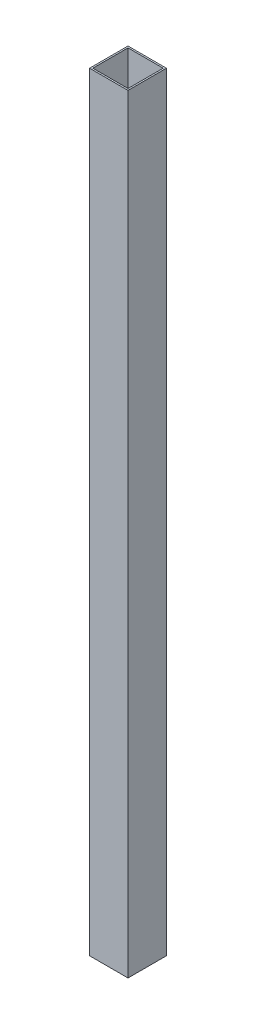
ISO-10303-21;
HEADER;
FILE_DESCRIPTION(('STEP AP214'),'2;1');
FILE_NAME('part.step','',(''),(''),'','','');
FILE_SCHEMA(('AUTOMOTIVE_DESIGN { 1 0 10303 214 1 1 1 1 }'));
ENDSEC;
DATA;
#1=APPLICATION_CONTEXT('core data for automotive mechanical design processes');
#2=APPLICATION_PROTOCOL_DEFINITION('international standard','automotive_design',2000,#1);
#3=PRODUCT_CONTEXT('',#1,'mechanical');
#4=PRODUCT('Part','Part','',(#3));
#5=PRODUCT_RELATED_PRODUCT_CATEGORY('part','',(#4));
#6=PRODUCT_DEFINITION_FORMATION('','',#4);
#7=PRODUCT_DEFINITION_CONTEXT('part definition',#1,'design');
#8=PRODUCT_DEFINITION('design','',#6,#7);
#9=PRODUCT_DEFINITION_SHAPE('','',#8);
#10=(LENGTH_UNIT() NAMED_UNIT(*) SI_UNIT(.MILLI.,.METRE.));
#11=(NAMED_UNIT(*) PLANE_ANGLE_UNIT() SI_UNIT($,.RADIAN.));
#12=(NAMED_UNIT(*) SI_UNIT($,.STERADIAN.) SOLID_ANGLE_UNIT());
#13=UNCERTAINTY_MEASURE_WITH_UNIT(LENGTH_MEASURE(1.E-05),#10,'distance_accuracy_value','');
#14=(GEOMETRIC_REPRESENTATION_CONTEXT(3) GLOBAL_UNCERTAINTY_ASSIGNED_CONTEXT((#13)) GLOBAL_UNIT_ASSIGNED_CONTEXT((#10,
#11,#12)) REPRESENTATION_CONTEXT('',''));
#15=CARTESIAN_POINT('',(0.,0.,0.));
#16=DIRECTION('',(0.,0.,1.));
#17=DIRECTION('',(1.,0.,0.));
#18=AXIS2_PLACEMENT_3D('',#15,#16,#17);
#19=CARTESIAN_POINT('',(0.,762.,0.));
#20=DIRECTION('',(0.,-1.,0.));
#21=DIRECTION('',(0.,0.,-1.));
#22=AXIS2_PLACEMENT_3D('',#19,#20,#21);
#23=PLANE('',#22);
#24=DIRECTION('',(0.,0.,1.));
#25=VECTOR('',#24,1.);
#26=CARTESIAN_POINT('',(0.,762.,0.));
#27=LINE('',#26,#25);
#28=CARTESIAN_POINT('',(0.,762.,-38.1));
#29=VERTEX_POINT('',#28);
#30=CARTESIAN_POINT('',(0.,762.,0.));
#31=VERTEX_POINT('',#30);
#32=EDGE_CURVE('E134',#29,#31,#27,.T.);
#33=ORIENTED_EDGE('',*,*,#32,.T.);
#34=DIRECTION('',(1.,0.,0.));
#35=VECTOR('',#34,1.);
#36=CARTESIAN_POINT('',(0.,762.,0.));
#37=LINE('',#36,#35);
#38=CARTESIAN_POINT('',(38.1,762.,0.));
#39=VERTEX_POINT('',#38);
#40=EDGE_CURVE('E137',#31,#39,#37,.T.);
#41=ORIENTED_EDGE('',*,*,#40,.T.);
#42=DIRECTION('',(0.,0.,-1.));
#43=VECTOR('',#42,1.);
#44=CARTESIAN_POINT('',(38.1,762.,0.));
#45=LINE('',#44,#43);
#46=CARTESIAN_POINT('',(38.1,762.,-38.1));
#47=VERTEX_POINT('',#46);
#48=EDGE_CURVE('E140',#39,#47,#45,.T.);
#49=ORIENTED_EDGE('',*,*,#48,.T.);
#50=DIRECTION('',(-1.,0.,0.));
#51=VECTOR('',#50,1.);
#52=CARTESIAN_POINT('',(0.,762.,-38.1));
#53=LINE('',#52,#51);
#54=EDGE_CURVE('E142',#47,#29,#53,.T.);
#55=ORIENTED_EDGE('',*,*,#54,.T.);
#56=EDGE_LOOP('',(#33,#41,#49,#55));
#57=FACE_BOUND('',#56,.T.);
#58=DIRECTION('',(0.,0.,1.));
#59=VECTOR('',#58,1.);
#60=CARTESIAN_POINT('',(1.6002,762.,-36.4998));
#61=LINE('',#60,#59);
#62=CARTESIAN_POINT('',(1.6002,762.,-36.4998));
#63=VERTEX_POINT('',#62);
#64=CARTESIAN_POINT('',(1.6002,762.,-1.6002));
#65=VERTEX_POINT('',#64);
#66=EDGE_CURVE('E98',#63,#65,#61,.T.);
#67=ORIENTED_EDGE('',*,*,#66,.F.);
#68=DIRECTION('',(-1.,0.,0.));
#69=VECTOR('',#68,1.);
#70=CARTESIAN_POINT('',(1.6002,762.,-36.4998));
#71=LINE('',#70,#69);
#72=CARTESIAN_POINT('',(36.4998,762.,-36.4998));
#73=VERTEX_POINT('',#72);
#74=EDGE_CURVE('E120',#73,#63,#71,.T.);
#75=ORIENTED_EDGE('',*,*,#74,.F.);
#76=DIRECTION('',(0.,0.,-1.));
#77=VECTOR('',#76,1.);
#78=CARTESIAN_POINT('',(36.4998,762.,-36.4998));
#79=LINE('',#78,#77);
#80=CARTESIAN_POINT('',(36.4998,762.,-1.6002));
#81=VERTEX_POINT('',#80);
#82=EDGE_CURVE('E118',#81,#73,#79,.T.);
#83=ORIENTED_EDGE('',*,*,#82,.F.);
#84=DIRECTION('',(1.,0.,0.));
#85=VECTOR('',#84,1.);
#86=CARTESIAN_POINT('',(1.6002,762.,-1.6002));
#87=LINE('',#86,#85);
#88=EDGE_CURVE('E106',#65,#81,#87,.T.);
#89=ORIENTED_EDGE('',*,*,#88,.F.);
#90=EDGE_LOOP('',(#67,#75,#83,#89));
#91=FACE_BOUND('',#90,.T.);
#92=ADVANCED_FACE('F33',(#57,#91),#23,.F.);
#93=CARTESIAN_POINT('',(0.,0.,0.));
#94=DIRECTION('',(0.,-1.,0.));
#95=DIRECTION('',(0.,0.,-1.));
#96=AXIS2_PLACEMENT_3D('',#93,#94,#95);
#97=PLANE('',#96);
#98=DIRECTION('',(0.,0.,1.));
#99=VECTOR('',#98,1.);
#100=CARTESIAN_POINT('',(0.,0.,0.));
#101=LINE('',#100,#99);
#102=CARTESIAN_POINT('',(0.,0.,-38.1));
#103=VERTEX_POINT('',#102);
#104=CARTESIAN_POINT('',(0.,0.,0.));
#105=VERTEX_POINT('',#104);
#106=EDGE_CURVE('E114',#103,#105,#101,.T.);
#107=ORIENTED_EDGE('',*,*,#106,.F.);
#108=DIRECTION('',(-1.,0.,0.));
#109=VECTOR('',#108,1.);
#110=CARTESIAN_POINT('',(0.,0.,-38.1));
#111=LINE('',#110,#109);
#112=CARTESIAN_POINT('',(38.1,0.,-38.1));
#113=VERTEX_POINT('',#112);
#114=EDGE_CURVE('E138',#113,#103,#111,.T.);
#115=ORIENTED_EDGE('',*,*,#114,.F.);
#116=DIRECTION('',(0.,0.,-1.));
#117=VECTOR('',#116,1.);
#118=CARTESIAN_POINT('',(38.1,0.,0.));
#119=LINE('',#118,#117);
#120=CARTESIAN_POINT('',(38.1,0.,0.));
#121=VERTEX_POINT('',#120);
#122=EDGE_CURVE('E149',#121,#113,#119,.T.);
#123=ORIENTED_EDGE('',*,*,#122,.F.);
#124=DIRECTION('',(1.,0.,0.));
#125=VECTOR('',#124,1.);
#126=CARTESIAN_POINT('',(0.,0.,0.));
#127=LINE('',#126,#125);
#128=EDGE_CURVE('E147',#105,#121,#127,.T.);
#129=ORIENTED_EDGE('',*,*,#128,.F.);
#130=EDGE_LOOP('',(#107,#115,#123,#129));
#131=FACE_BOUND('',#130,.T.);
#132=DIRECTION('',(-1.,0.,0.));
#133=VECTOR('',#132,1.);
#134=CARTESIAN_POINT('',(1.6002,0.,-36.4998));
#135=LINE('',#134,#133);
#136=CARTESIAN_POINT('',(36.4998,0.,-36.4998));
#137=VERTEX_POINT('',#136);
#138=CARTESIAN_POINT('',(1.6002,0.,-36.4998));
#139=VERTEX_POINT('',#138);
#140=EDGE_CURVE('E107',#137,#139,#135,.T.);
#141=ORIENTED_EDGE('',*,*,#140,.T.);
#142=DIRECTION('',(0.,0.,1.));
#143=VECTOR('',#142,1.);
#144=CARTESIAN_POINT('',(1.6002,0.,-36.4998));
#145=LINE('',#144,#143);
#146=CARTESIAN_POINT('',(1.6002,0.,-1.6002));
#147=VERTEX_POINT('',#146);
#148=EDGE_CURVE('E56',#139,#147,#145,.T.);
#149=ORIENTED_EDGE('',*,*,#148,.T.);
#150=DIRECTION('',(1.,0.,0.));
#151=VECTOR('',#150,1.);
#152=CARTESIAN_POINT('',(1.6002,0.,-1.6002));
#153=LINE('',#152,#151);
#154=CARTESIAN_POINT('',(36.4998,0.,-1.6002));
#155=VERTEX_POINT('',#154);
#156=EDGE_CURVE('E113',#147,#155,#153,.T.);
#157=ORIENTED_EDGE('',*,*,#156,.T.);
#158=DIRECTION('',(0.,0.,-1.));
#159=VECTOR('',#158,1.);
#160=CARTESIAN_POINT('',(36.4998,0.,-36.4998));
#161=LINE('',#160,#159);
#162=EDGE_CURVE('E126',#155,#137,#161,.T.);
#163=ORIENTED_EDGE('',*,*,#162,.T.);
#164=EDGE_LOOP('',(#141,#149,#157,#163));
#165=FACE_BOUND('',#164,.T.);
#166=ADVANCED_FACE('F167',(#131,#165),#97,.T.);
#167=CARTESIAN_POINT('',(0.,762.,0.));
#168=DIRECTION('',(1.,0.,0.));
#169=DIRECTION('',(0.,0.,-1.));
#170=AXIS2_PLACEMENT_3D('',#167,#168,#169);
#171=PLANE('',#170);
#172=ORIENTED_EDGE('',*,*,#106,.T.);
#173=DIRECTION('',(0.,-1.,0.));
#174=VECTOR('',#173,1.);
#175=CARTESIAN_POINT('',(0.,762.,0.));
#176=LINE('',#175,#174);
#177=EDGE_CURVE('E11',#31,#105,#176,.T.);
#178=ORIENTED_EDGE('',*,*,#177,.F.);
#179=ORIENTED_EDGE('',*,*,#32,.F.);
#180=DIRECTION('',(0.,-1.,0.));
#181=VECTOR('',#180,1.);
#182=CARTESIAN_POINT('',(0.,762.,-38.1));
#183=LINE('',#182,#181);
#184=EDGE_CURVE('E144',#29,#103,#183,.T.);
#185=ORIENTED_EDGE('',*,*,#184,.T.);
#186=EDGE_LOOP('',(#172,#178,#179,#185));
#187=FACE_BOUND('',#186,.T.);
#188=ADVANCED_FACE('F35',(#187),#171,.F.);
#189=CARTESIAN_POINT('',(0.,762.,0.));
#190=DIRECTION('',(0.,0.,-1.));
#191=DIRECTION('',(-1.,0.,0.));
#192=AXIS2_PLACEMENT_3D('',#189,#190,#191);
#193=PLANE('',#192);
#194=ORIENTED_EDGE('',*,*,#128,.T.);
#195=DIRECTION('',(0.,-1.,0.));
#196=VECTOR('',#195,1.);
#197=CARTESIAN_POINT('',(38.1,762.,0.));
#198=LINE('',#197,#196);
#199=EDGE_CURVE('E41',#39,#121,#198,.T.);
#200=ORIENTED_EDGE('',*,*,#199,.F.);
#201=ORIENTED_EDGE('',*,*,#40,.F.);
#202=ORIENTED_EDGE('',*,*,#177,.T.);
#203=EDGE_LOOP('',(#194,#200,#201,#202));
#204=FACE_BOUND('',#203,.T.);
#205=ADVANCED_FACE('F177',(#204),#193,.F.);
#206=CARTESIAN_POINT('',(38.1,762.,0.));
#207=DIRECTION('',(-1.,0.,0.));
#208=DIRECTION('',(0.,0.,1.));
#209=AXIS2_PLACEMENT_3D('',#206,#207,#208);
#210=PLANE('',#209);
#211=ORIENTED_EDGE('',*,*,#122,.T.);
#212=DIRECTION('',(0.,-1.,0.));
#213=VECTOR('',#212,1.);
#214=CARTESIAN_POINT('',(38.1,762.,-38.1));
#215=LINE('',#214,#213);
#216=EDGE_CURVE('E154',#47,#113,#215,.T.);
#217=ORIENTED_EDGE('',*,*,#216,.F.);
#218=ORIENTED_EDGE('',*,*,#48,.F.);
#219=ORIENTED_EDGE('',*,*,#199,.T.);
#220=EDGE_LOOP('',(#211,#217,#218,#219));
#221=FACE_BOUND('',#220,.T.);
#222=ADVANCED_FACE('F161',(#221),#210,.F.);
#223=CARTESIAN_POINT('',(0.,762.,-38.1));
#224=DIRECTION('',(0.,0.,1.));
#225=DIRECTION('',(1.,0.,0.));
#226=AXIS2_PLACEMENT_3D('',#223,#224,#225);
#227=PLANE('',#226);
#228=ORIENTED_EDGE('',*,*,#114,.T.);
#229=ORIENTED_EDGE('',*,*,#184,.F.);
#230=ORIENTED_EDGE('',*,*,#54,.F.);
#231=ORIENTED_EDGE('',*,*,#216,.T.);
#232=EDGE_LOOP('',(#228,#229,#230,#231));
#233=FACE_BOUND('',#232,.T.);
#234=ADVANCED_FACE('F171',(#233),#227,.F.);
#235=CARTESIAN_POINT('',(1.6002,762.,-36.4998));
#236=DIRECTION('',(1.,0.,0.));
#237=DIRECTION('',(0.,0.,-1.));
#238=AXIS2_PLACEMENT_3D('',#235,#236,#237);
#239=PLANE('',#238);
#240=ORIENTED_EDGE('',*,*,#148,.F.);
#241=DIRECTION('',(0.,-1.,0.));
#242=VECTOR('',#241,1.);
#243=CARTESIAN_POINT('',(1.6002,762.,-36.4998));
#244=LINE('',#243,#242);
#245=EDGE_CURVE('E102',#63,#139,#244,.T.);
#246=ORIENTED_EDGE('',*,*,#245,.F.);
#247=ORIENTED_EDGE('',*,*,#66,.T.);
#248=DIRECTION('',(0.,-1.,0.));
#249=VECTOR('',#248,1.);
#250=CARTESIAN_POINT('',(1.6002,762.,-1.6002));
#251=LINE('',#250,#249);
#252=EDGE_CURVE('E101',#65,#147,#251,.T.);
#253=ORIENTED_EDGE('',*,*,#252,.T.);
#254=EDGE_LOOP('',(#240,#246,#247,#253));
#255=FACE_BOUND('',#254,.T.);
#256=ADVANCED_FACE('F100',(#255),#239,.T.);
#257=CARTESIAN_POINT('',(1.6002,762.,-1.6002));
#258=DIRECTION('',(0.,0.,-1.));
#259=DIRECTION('',(-1.,0.,0.));
#260=AXIS2_PLACEMENT_3D('',#257,#258,#259);
#261=PLANE('',#260);
#262=ORIENTED_EDGE('',*,*,#156,.F.);
#263=ORIENTED_EDGE('',*,*,#252,.F.);
#264=ORIENTED_EDGE('',*,*,#88,.T.);
#265=DIRECTION('',(0.,-1.,0.));
#266=VECTOR('',#265,1.);
#267=CARTESIAN_POINT('',(36.4998,762.,-1.6002));
#268=LINE('',#267,#266);
#269=EDGE_CURVE('E115',#81,#155,#268,.T.);
#270=ORIENTED_EDGE('',*,*,#269,.T.);
#271=EDGE_LOOP('',(#262,#263,#264,#270));
#272=FACE_BOUND('',#271,.T.);
#273=ADVANCED_FACE('F110',(#272),#261,.T.);
#274=CARTESIAN_POINT('',(36.4998,762.,-36.4998));
#275=DIRECTION('',(-1.,0.,0.));
#276=DIRECTION('',(0.,0.,1.));
#277=AXIS2_PLACEMENT_3D('',#274,#275,#276);
#278=PLANE('',#277);
#279=ORIENTED_EDGE('',*,*,#162,.F.);
#280=ORIENTED_EDGE('',*,*,#269,.F.);
#281=ORIENTED_EDGE('',*,*,#82,.T.);
#282=DIRECTION('',(0.,-1.,0.));
#283=VECTOR('',#282,1.);
#284=CARTESIAN_POINT('',(36.4998,762.,-36.4998));
#285=LINE('',#284,#283);
#286=EDGE_CURVE('E48',#73,#137,#285,.T.);
#287=ORIENTED_EDGE('',*,*,#286,.T.);
#288=EDGE_LOOP('',(#279,#280,#281,#287));
#289=FACE_BOUND('',#288,.T.);
#290=ADVANCED_FACE('F200',(#289),#278,.T.);
#291=CARTESIAN_POINT('',(1.6002,762.,-36.4998));
#292=DIRECTION('',(0.,0.,1.));
#293=DIRECTION('',(1.,0.,0.));
#294=AXIS2_PLACEMENT_3D('',#291,#292,#293);
#295=PLANE('',#294);
#296=ORIENTED_EDGE('',*,*,#140,.F.);
#297=ORIENTED_EDGE('',*,*,#286,.F.);
#298=ORIENTED_EDGE('',*,*,#74,.T.);
#299=ORIENTED_EDGE('',*,*,#245,.T.);
#300=EDGE_LOOP('',(#296,#297,#298,#299));
#301=FACE_BOUND('',#300,.T.);
#302=ADVANCED_FACE('F204',(#301),#295,.T.);
#303=CLOSED_SHELL('',(#92,#166,#188,#205,#222,#234,#256,#273,#290,#302));
#304=MANIFOLD_SOLID_BREP('B2',#303);
#305=ADVANCED_BREP_SHAPE_REPRESENTATION('',(#18,#304),#14);
#306=SHAPE_DEFINITION_REPRESENTATION(#9,#305);
ENDSEC;
END-ISO-10303-21;
